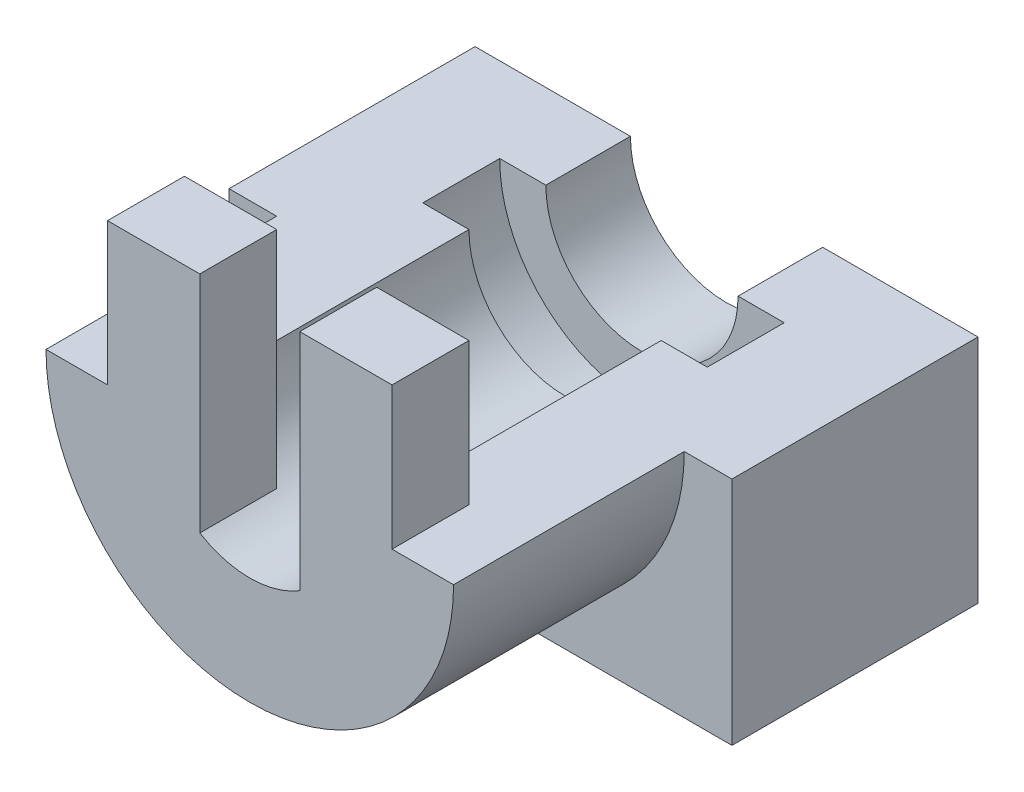
ISO-10303-21;
HEADER;
FILE_DESCRIPTION(('STEP AP214'),'2;1');
FILE_NAME('part.step','',(''),(''),'','','');
FILE_SCHEMA(('AUTOMOTIVE_DESIGN { 1 0 10303 214 1 1 1 1 }'));
ENDSEC;
DATA;
#1=APPLICATION_CONTEXT('core data for automotive mechanical design processes');
#2=APPLICATION_PROTOCOL_DEFINITION('international standard','automotive_design',2000,#1);
#3=PRODUCT_CONTEXT('',#1,'mechanical');
#4=PRODUCT('Part','Part','',(#3));
#5=PRODUCT_RELATED_PRODUCT_CATEGORY('part','',(#4));
#6=PRODUCT_DEFINITION_FORMATION('','',#4);
#7=PRODUCT_DEFINITION_CONTEXT('part definition',#1,'design');
#8=PRODUCT_DEFINITION('design','',#6,#7);
#9=PRODUCT_DEFINITION_SHAPE('','',#8);
#10=(LENGTH_UNIT() NAMED_UNIT(*) SI_UNIT(.MILLI.,.METRE.));
#11=(NAMED_UNIT(*) PLANE_ANGLE_UNIT() SI_UNIT($,.RADIAN.));
#12=(NAMED_UNIT(*) SI_UNIT($,.STERADIAN.) SOLID_ANGLE_UNIT());
#13=UNCERTAINTY_MEASURE_WITH_UNIT(LENGTH_MEASURE(1.E-05),#10,'distance_accuracy_value','');
#14=(GEOMETRIC_REPRESENTATION_CONTEXT(3) GLOBAL_UNCERTAINTY_ASSIGNED_CONTEXT((#13)) GLOBAL_UNIT_ASSIGNED_CONTEXT((#10,
#11,#12)) REPRESENTATION_CONTEXT('',''));
#15=CARTESIAN_POINT('',(0.,0.,0.));
#16=DIRECTION('',(0.,0.,1.));
#17=DIRECTION('',(1.,0.,0.));
#18=AXIS2_PLACEMENT_3D('',#15,#16,#17);
#19=CARTESIAN_POINT('',(0.,0.,0.));
#20=DIRECTION('',(0.,0.,1.));
#21=DIRECTION('',(1.,0.,0.));
#22=AXIS2_PLACEMENT_3D('',#19,#20,#21);
#23=PLANE('',#22);
#24=CARTESIAN_POINT('',(0.,0.,0.));
#25=DIRECTION('',(0.,0.,1.));
#26=DIRECTION('',(1.,0.,0.));
#27=AXIS2_PLACEMENT_3D('',#24,#25,#26);
#28=CIRCLE('',#27,6.25);
#29=CARTESIAN_POINT('',(-6.25,0.,0.));
#30=VERTEX_POINT('',#29);
#31=CARTESIAN_POINT('',(-3.25,-5.33853912601566,0.));
#32=VERTEX_POINT('',#31);
#33=EDGE_CURVE('E50',#30,#32,#28,.T.);
#34=ORIENTED_EDGE('',*,*,#33,.F.);
#35=DIRECTION('',(1.,0.,0.));
#36=VECTOR('',#35,1.);
#37=CARTESIAN_POINT('',(0.,0.,0.));
#38=LINE('',#37,#36);
#39=CARTESIAN_POINT('',(-9.25,0.,0.));
#40=VERTEX_POINT('',#39);
#41=EDGE_CURVE('E266',#40,#30,#38,.T.);
#42=ORIENTED_EDGE('',*,*,#41,.F.);
#43=DIRECTION('',(0.,-1.,0.));
#44=VECTOR('',#43,1.);
#45=CARTESIAN_POINT('',(-9.25,0.,0.));
#46=LINE('',#45,#44);
#47=CARTESIAN_POINT('',(-9.25,9.25,0.));
#48=VERTEX_POINT('',#47);
#49=EDGE_CURVE('E281',#48,#40,#46,.T.);
#50=ORIENTED_EDGE('',*,*,#49,.F.);
#51=DIRECTION('',(1.,0.,0.));
#52=VECTOR('',#51,1.);
#53=CARTESIAN_POINT('',(0.,9.25,0.));
#54=LINE('',#53,#52);
#55=CARTESIAN_POINT('',(-3.25,9.25000000000001,0.));
#56=VERTEX_POINT('',#55);
#57=EDGE_CURVE('E307',#48,#56,#54,.T.);
#58=ORIENTED_EDGE('',*,*,#57,.T.);
#59=DIRECTION('',(0.,-1.,0.));
#60=VECTOR('',#59,1.);
#61=CARTESIAN_POINT('',(-3.25,0.,0.));
#62=LINE('',#61,#60);
#63=EDGE_CURVE('E305',#56,#32,#62,.T.);
#64=ORIENTED_EDGE('',*,*,#63,.T.);
#65=EDGE_LOOP('',(#34,#42,#50,#58,#64));
#66=FACE_BOUND('',#65,.T.);
#67=ADVANCED_FACE('F40',(#66),#23,.F.);
#68=CARTESIAN_POINT('',(3.25000000000004,-5.33853912601563,0.));
#69=VERTEX_POINT('',#68);
#70=CARTESIAN_POINT('',(6.25,0.,0.));
#71=VERTEX_POINT('',#70);
#72=EDGE_CURVE('E11',#69,#71,#28,.T.);
#73=ORIENTED_EDGE('',*,*,#72,.F.);
#74=DIRECTION('',(0.,-1.,0.));
#75=VECTOR('',#74,1.);
#76=CARTESIAN_POINT('',(3.25,0.,0.));
#77=LINE('',#76,#75);
#78=CARTESIAN_POINT('',(3.25,9.25,0.));
#79=VERTEX_POINT('',#78);
#80=EDGE_CURVE('E302',#79,#69,#77,.T.);
#81=ORIENTED_EDGE('',*,*,#80,.F.);
#82=DIRECTION('',(1.,0.,0.));
#83=VECTOR('',#82,1.);
#84=CARTESIAN_POINT('',(0.,9.25,0.));
#85=LINE('',#84,#83);
#86=CARTESIAN_POINT('',(9.25,9.25,0.));
#87=VERTEX_POINT('',#86);
#88=EDGE_CURVE('E299',#79,#87,#85,.T.);
#89=ORIENTED_EDGE('',*,*,#88,.T.);
#90=DIRECTION('',(0.,-1.,0.));
#91=VECTOR('',#90,1.);
#92=CARTESIAN_POINT('',(9.25,0.,0.));
#93=LINE('',#92,#91);
#94=CARTESIAN_POINT('',(9.25,0.,0.));
#95=VERTEX_POINT('',#94);
#96=EDGE_CURVE('E275',#87,#95,#93,.T.);
#97=ORIENTED_EDGE('',*,*,#96,.T.);
#98=DIRECTION('',(1.,0.,0.));
#99=VECTOR('',#98,1.);
#100=CARTESIAN_POINT('',(0.,0.,0.));
#101=LINE('',#100,#99);
#102=EDGE_CURVE('E268',#71,#95,#101,.T.);
#103=ORIENTED_EDGE('',*,*,#102,.F.);
#104=EDGE_LOOP('',(#73,#81,#89,#97,#103));
#105=FACE_BOUND('',#104,.T.);
#106=ADVANCED_FACE('F336',(#105),#23,.F.);
#107=CARTESIAN_POINT('',(9.25,0.,5.));
#108=DIRECTION('',(1.,0.,0.));
#109=DIRECTION('',(0.,1.,0.));
#110=AXIS2_PLACEMENT_3D('',#107,#108,#109);
#111=PLANE('',#110);
#112=ORIENTED_EDGE('',*,*,#96,.F.);
#113=DIRECTION('',(0.,0.,-1.));
#114=VECTOR('',#113,1.);
#115=CARTESIAN_POINT('',(9.25,9.25,5.));
#116=LINE('',#115,#114);
#117=CARTESIAN_POINT('',(9.25,9.25,5.));
#118=VERTEX_POINT('',#117);
#119=EDGE_CURVE('E324',#118,#87,#116,.T.);
#120=ORIENTED_EDGE('',*,*,#119,.F.);
#121=DIRECTION('',(0.,-1.,0.));
#122=VECTOR('',#121,1.);
#123=CARTESIAN_POINT('',(9.25,0.,5.));
#124=LINE('',#123,#122);
#125=CARTESIAN_POINT('',(9.25,0.,5.));
#126=VERTEX_POINT('',#125);
#127=EDGE_CURVE('E278',#118,#126,#124,.T.);
#128=ORIENTED_EDGE('',*,*,#127,.T.);
#129=DIRECTION('',(0.,0.,-1.));
#130=VECTOR('',#129,1.);
#131=CARTESIAN_POINT('',(9.25,0.,5.));
#132=LINE('',#131,#130);
#133=EDGE_CURVE('E44',#126,#95,#132,.T.);
#134=ORIENTED_EDGE('',*,*,#133,.T.);
#135=EDGE_LOOP('',(#112,#120,#128,#134));
#136=FACE_BOUND('',#135,.T.);
#137=ADVANCED_FACE('F42',(#136),#111,.T.);
#138=CARTESIAN_POINT('',(0.,9.25,5.));
#139=DIRECTION('',(0.,1.,0.));
#140=DIRECTION('',(0.,0.,1.));
#141=AXIS2_PLACEMENT_3D('',#138,#139,#140);
#142=PLANE('',#141);
#143=ORIENTED_EDGE('',*,*,#88,.F.);
#144=DIRECTION('',(0.,0.,-1.));
#145=VECTOR('',#144,1.);
#146=CARTESIAN_POINT('',(3.25,9.25,5.));
#147=LINE('',#146,#145);
#148=CARTESIAN_POINT('',(3.25,9.25,5.));
#149=VERTEX_POINT('',#148);
#150=EDGE_CURVE('E323',#149,#79,#147,.T.);
#151=ORIENTED_EDGE('',*,*,#150,.F.);
#152=DIRECTION('',(1.,0.,0.));
#153=VECTOR('',#152,1.);
#154=CARTESIAN_POINT('',(0.,9.25,5.));
#155=LINE('',#154,#153);
#156=EDGE_CURVE('E280',#149,#118,#155,.T.);
#157=ORIENTED_EDGE('',*,*,#156,.T.);
#158=ORIENTED_EDGE('',*,*,#119,.T.);
#159=EDGE_LOOP('',(#143,#151,#157,#158));
#160=FACE_BOUND('',#159,.T.);
#161=ADVANCED_FACE('F346',(#160),#142,.T.);
#162=CARTESIAN_POINT('',(3.25,0.,5.));
#163=DIRECTION('',(1.,0.,0.));
#164=DIRECTION('',(0.,1.,0.));
#165=AXIS2_PLACEMENT_3D('',#162,#163,#164);
#166=PLANE('',#165);
#167=ORIENTED_EDGE('',*,*,#80,.T.);
#168=DIRECTION('',(0.,0.,-1.));
#169=VECTOR('',#168,1.);
#170=CARTESIAN_POINT('',(3.25000000000004,-5.33853912601563,5.));
#171=LINE('',#170,#169);
#172=CARTESIAN_POINT('',(3.25000000000004,-5.33853912601563,5.));
#173=VERTEX_POINT('',#172);
#174=EDGE_CURVE('E320',#173,#69,#171,.T.);
#175=ORIENTED_EDGE('',*,*,#174,.F.);
#176=DIRECTION('',(0.,-1.,0.));
#177=VECTOR('',#176,1.);
#178=CARTESIAN_POINT('',(3.25,0.,5.));
#179=LINE('',#178,#177);
#180=EDGE_CURVE('E284',#149,#173,#179,.T.);
#181=ORIENTED_EDGE('',*,*,#180,.F.);
#182=ORIENTED_EDGE('',*,*,#150,.T.);
#183=EDGE_LOOP('',(#167,#175,#181,#182));
#184=FACE_BOUND('',#183,.T.);
#185=ADVANCED_FACE('F345',(#184),#166,.F.);
#186=CARTESIAN_POINT('',(0.,0.,5.));
#187=DIRECTION('',(0.,0.,-1.));
#188=DIRECTION('',(-1.,0.,0.));
#189=AXIS2_PLACEMENT_3D('',#186,#187,#188);
#190=CYLINDRICAL_SURFACE('',#189,6.25);
#191=ORIENTED_EDGE('',*,*,#174,.T.);
#192=ORIENTED_EDGE('',*,*,#72,.T.);
#193=DIRECTION('',(0.,0.,1.));
#194=VECTOR('',#193,1.);
#195=CARTESIAN_POINT('',(6.25,0.,-10.));
#196=LINE('',#195,#194);
#197=CARTESIAN_POINT('',(6.25,0.,-15.5));
#198=VERTEX_POINT('',#197);
#199=EDGE_CURVE('E272',#198,#71,#196,.T.);
#200=ORIENTED_EDGE('',*,*,#199,.F.);
#201=CARTESIAN_POINT('',(0.,0.,-15.5));
#202=DIRECTION('',(0.,0.,1.));
#203=DIRECTION('',(-1.,0.,0.));
#204=AXIS2_PLACEMENT_3D('',#201,#202,#203);
#205=CIRCLE('',#204,6.25);
#206=CARTESIAN_POINT('',(-6.25,0.,-15.5));
#207=VERTEX_POINT('',#206);
#208=EDGE_CURVE('E215',#207,#198,#205,.T.);
#209=ORIENTED_EDGE('',*,*,#208,.F.);
#210=DIRECTION('',(0.,0.,1.));
#211=VECTOR('',#210,1.);
#212=CARTESIAN_POINT('',(-6.25,0.,-10.));
#213=LINE('',#212,#211);
#214=EDGE_CURVE('E271',#207,#30,#213,.T.);
#215=ORIENTED_EDGE('',*,*,#214,.T.);
#216=ORIENTED_EDGE('',*,*,#33,.T.);
#217=DIRECTION('',(0.,0.,-1.));
#218=VECTOR('',#217,1.);
#219=CARTESIAN_POINT('',(-3.25,-5.33853912601566,5.));
#220=LINE('',#219,#218);
#221=CARTESIAN_POINT('',(-3.25,-5.33853912601566,5.));
#222=VERTEX_POINT('',#221);
#223=EDGE_CURVE('E318',#222,#32,#220,.T.);
#224=ORIENTED_EDGE('',*,*,#223,.F.);
#225=CARTESIAN_POINT('',(0.,0.,5.));
#226=DIRECTION('',(0.,0.,1.));
#227=DIRECTION('',(1.,0.,0.));
#228=AXIS2_PLACEMENT_3D('',#225,#226,#227);
#229=CIRCLE('',#228,6.25);
#230=EDGE_CURVE('E286',#222,#173,#229,.T.);
#231=ORIENTED_EDGE('',*,*,#230,.T.);
#232=EDGE_LOOP('',(#191,#192,#200,#209,#215,#216,#224,#231));
#233=FACE_BOUND('',#232,.T.);
#234=ADVANCED_FACE('F339',(#233),#190,.F.);
#235=CARTESIAN_POINT('',(-3.25,0.,5.));
#236=DIRECTION('',(1.,0.,0.));
#237=DIRECTION('',(0.,1.,0.));
#238=AXIS2_PLACEMENT_3D('',#235,#236,#237);
#239=PLANE('',#238);
#240=ORIENTED_EDGE('',*,*,#63,.F.);
#241=DIRECTION('',(0.,0.,-1.));
#242=VECTOR('',#241,1.);
#243=CARTESIAN_POINT('',(-3.25,9.25000000000001,5.));
#244=LINE('',#243,#242);
#245=CARTESIAN_POINT('',(-3.25,9.25000000000001,5.));
#246=VERTEX_POINT('',#245);
#247=EDGE_CURVE('E316',#246,#56,#244,.T.);
#248=ORIENTED_EDGE('',*,*,#247,.F.);
#249=DIRECTION('',(0.,-1.,0.));
#250=VECTOR('',#249,1.);
#251=CARTESIAN_POINT('',(-3.25,0.,5.));
#252=LINE('',#251,#250);
#253=EDGE_CURVE('E289',#246,#222,#252,.T.);
#254=ORIENTED_EDGE('',*,*,#253,.T.);
#255=ORIENTED_EDGE('',*,*,#223,.T.);
#256=EDGE_LOOP('',(#240,#248,#254,#255));
#257=FACE_BOUND('',#256,.T.);
#258=ADVANCED_FACE('F392',(#257),#239,.T.);
#259=CARTESIAN_POINT('',(0.,9.25,5.));
#260=DIRECTION('',(0.,1.,0.));
#261=DIRECTION('',(0.,0.,1.));
#262=AXIS2_PLACEMENT_3D('',#259,#260,#261);
#263=PLANE('',#262);
#264=ORIENTED_EDGE('',*,*,#57,.F.);
#265=DIRECTION('',(0.,0.,-1.));
#266=VECTOR('',#265,1.);
#267=CARTESIAN_POINT('',(-9.25,9.25,5.));
#268=LINE('',#267,#266);
#269=CARTESIAN_POINT('',(-9.25,9.25,5.));
#270=VERTEX_POINT('',#269);
#271=EDGE_CURVE('E314',#270,#48,#268,.T.);
#272=ORIENTED_EDGE('',*,*,#271,.F.);
#273=DIRECTION('',(1.,0.,0.));
#274=VECTOR('',#273,1.);
#275=CARTESIAN_POINT('',(0.,9.25,5.));
#276=LINE('',#275,#274);
#277=EDGE_CURVE('E292',#270,#246,#276,.T.);
#278=ORIENTED_EDGE('',*,*,#277,.T.);
#279=ORIENTED_EDGE('',*,*,#247,.T.);
#280=EDGE_LOOP('',(#264,#272,#278,#279));
#281=FACE_BOUND('',#280,.T.);
#282=ADVANCED_FACE('F395',(#281),#263,.T.);
#283=CARTESIAN_POINT('',(-9.25,0.,5.));
#284=DIRECTION('',(1.,0.,0.));
#285=DIRECTION('',(0.,1.,0.));
#286=AXIS2_PLACEMENT_3D('',#283,#284,#285);
#287=PLANE('',#286);
#288=ORIENTED_EDGE('',*,*,#49,.T.);
#289=DIRECTION('',(0.,0.,-1.));
#290=VECTOR('',#289,1.);
#291=CARTESIAN_POINT('',(-9.25,0.,5.));
#292=LINE('',#291,#290);
#293=CARTESIAN_POINT('',(-9.25,0.,5.));
#294=VERTEX_POINT('',#293);
#295=EDGE_CURVE('E297',#294,#40,#292,.T.);
#296=ORIENTED_EDGE('',*,*,#295,.F.);
#297=DIRECTION('',(0.,-1.,0.));
#298=VECTOR('',#297,1.);
#299=CARTESIAN_POINT('',(-9.25,0.,5.));
#300=LINE('',#299,#298);
#301=EDGE_CURVE('E295',#270,#294,#300,.T.);
#302=ORIENTED_EDGE('',*,*,#301,.F.);
#303=ORIENTED_EDGE('',*,*,#271,.T.);
#304=EDGE_LOOP('',(#288,#296,#302,#303));
#305=FACE_BOUND('',#304,.T.);
#306=ADVANCED_FACE('F399',(#305),#287,.F.);
#307=CARTESIAN_POINT('',(0.,0.,5.));
#308=DIRECTION('',(0.,0.,1.));
#309=DIRECTION('',(1.,0.,0.));
#310=AXIS2_PLACEMENT_3D('',#307,#308,#309);
#311=PLANE('',#310);
#312=ORIENTED_EDGE('',*,*,#301,.T.);
#313=DIRECTION('',(-1.,0.,0.));
#314=VECTOR('',#313,1.);
#315=CARTESIAN_POINT('',(0.,0.,5.));
#316=LINE('',#315,#314);
#317=CARTESIAN_POINT('',(-13.25,0.,5.));
#318=VERTEX_POINT('',#317);
#319=EDGE_CURVE('E259',#294,#318,#316,.T.);
#320=ORIENTED_EDGE('',*,*,#319,.T.);
#321=CARTESIAN_POINT('',(0.,0.,5.));
#322=DIRECTION('',(0.,0.,1.));
#323=DIRECTION('',(1.,0.,0.));
#324=AXIS2_PLACEMENT_3D('',#321,#322,#323);
#325=CIRCLE('',#324,13.25);
#326=CARTESIAN_POINT('',(13.25,0.,5.));
#327=VERTEX_POINT('',#326);
#328=EDGE_CURVE('E256',#318,#327,#325,.T.);
#329=ORIENTED_EDGE('',*,*,#328,.T.);
#330=DIRECTION('',(-1.,0.,0.));
#331=VECTOR('',#330,1.);
#332=CARTESIAN_POINT('',(0.,0.,5.));
#333=LINE('',#332,#331);
#334=EDGE_CURVE('E253',#327,#126,#333,.T.);
#335=ORIENTED_EDGE('',*,*,#334,.T.);
#336=ORIENTED_EDGE('',*,*,#127,.F.);
#337=ORIENTED_EDGE('',*,*,#156,.F.);
#338=ORIENTED_EDGE('',*,*,#180,.T.);
#339=ORIENTED_EDGE('',*,*,#230,.F.);
#340=ORIENTED_EDGE('',*,*,#253,.F.);
#341=ORIENTED_EDGE('',*,*,#277,.F.);
#342=EDGE_LOOP('',(#312,#320,#329,#335,#336,#337,#338,#339,#340,#341));
#343=FACE_BOUND('',#342,.T.);
#344=ADVANCED_FACE('F349',(#343),#311,.T.);
#345=CARTESIAN_POINT('',(0.,0.,-10.));
#346=DIRECTION('',(0.,-1.,0.));
#347=DIRECTION('',(0.,0.,-1.));
#348=AXIS2_PLACEMENT_3D('',#345,#346,#347);
#349=PLANE('',#348);
#350=ORIENTED_EDGE('',*,*,#102,.T.);
#351=ORIENTED_EDGE('',*,*,#133,.F.);
#352=ORIENTED_EDGE('',*,*,#334,.F.);
#353=DIRECTION('',(0.,0.,-1.));
#354=VECTOR('',#353,1.);
#355=CARTESIAN_POINT('',(13.25,0.,34.6279007018722));
#356=LINE('',#355,#354);
#357=CARTESIAN_POINT('',(13.25,0.,-10.));
#358=VERTEX_POINT('',#357);
#359=EDGE_CURVE('E252',#327,#358,#356,.T.);
#360=ORIENTED_EDGE('',*,*,#359,.T.);
#361=DIRECTION('',(-1.,0.,0.));
#362=VECTOR('',#361,1.);
#363=CARTESIAN_POINT('',(0.,0.,-10.));
#364=LINE('',#363,#362);
#365=CARTESIAN_POINT('',(16.35,0.,-10.));
#366=VERTEX_POINT('',#365);
#367=EDGE_CURVE('E231',#366,#358,#364,.T.);
#368=ORIENTED_EDGE('',*,*,#367,.F.);
#369=DIRECTION('',(0.,0.,1.));
#370=VECTOR('',#369,1.);
#371=CARTESIAN_POINT('',(16.35,0.,-20.5));
#372=LINE('',#371,#370);
#373=CARTESIAN_POINT('',(16.35,0.,-26.));
#374=VERTEX_POINT('',#373);
#375=EDGE_CURVE('E240',#374,#366,#372,.T.);
#376=ORIENTED_EDGE('',*,*,#375,.F.);
#377=DIRECTION('',(1.,0.,0.));
#378=VECTOR('',#377,1.);
#379=CARTESIAN_POINT('',(16.35,0.,-26.));
#380=LINE('',#379,#378);
#381=CARTESIAN_POINT('',(6.25,0.,-26.));
#382=VERTEX_POINT('',#381);
#383=EDGE_CURVE('E190',#382,#374,#380,.T.);
#384=ORIENTED_EDGE('',*,*,#383,.F.);
#385=DIRECTION('',(0.,0.,1.));
#386=VECTOR('',#385,1.);
#387=CARTESIAN_POINT('',(6.25,0.,-26.));
#388=LINE('',#387,#386);
#389=CARTESIAN_POINT('',(6.25,0.,-20.5));
#390=VERTEX_POINT('',#389);
#391=EDGE_CURVE('E186',#382,#390,#388,.T.);
#392=ORIENTED_EDGE('',*,*,#391,.T.);
#393=DIRECTION('',(1.,0.,0.));
#394=VECTOR('',#393,1.);
#395=CARTESIAN_POINT('',(16.35,0.,-20.5));
#396=LINE('',#395,#394);
#397=CARTESIAN_POINT('',(9.25,0.,-20.5));
#398=VERTEX_POINT('',#397);
#399=EDGE_CURVE('E201',#390,#398,#396,.T.);
#400=ORIENTED_EDGE('',*,*,#399,.T.);
#401=DIRECTION('',(0.,0.,1.));
#402=VECTOR('',#401,1.);
#403=CARTESIAN_POINT('',(9.25,0.,-20.5));
#404=LINE('',#403,#402);
#405=CARTESIAN_POINT('',(9.25,0.,-15.5));
#406=VERTEX_POINT('',#405);
#407=EDGE_CURVE('E242',#398,#406,#404,.T.);
#408=ORIENTED_EDGE('',*,*,#407,.T.);
#409=DIRECTION('',(1.,0.,0.));
#410=VECTOR('',#409,1.);
#411=CARTESIAN_POINT('',(6.25,0.,-15.5));
#412=LINE('',#411,#410);
#413=EDGE_CURVE('E218',#198,#406,#412,.T.);
#414=ORIENTED_EDGE('',*,*,#413,.F.);
#415=ORIENTED_EDGE('',*,*,#199,.T.);
#416=EDGE_LOOP('',(#350,#351,#352,#360,#368,#376,#384,#392,#400,#408,#414,#415));
#417=FACE_BOUND('',#416,.T.);
#418=ADVANCED_FACE('F333',(#417),#349,.F.);
#419=CARTESIAN_POINT('',(0.,0.,-10.));
#420=DIRECTION('',(0.,-1.,0.));
#421=DIRECTION('',(0.,0.,-1.));
#422=AXIS2_PLACEMENT_3D('',#419,#420,#421);
#423=PLANE('',#422);
#424=ORIENTED_EDGE('',*,*,#214,.F.);
#425=DIRECTION('',(1.,0.,0.));
#426=VECTOR('',#425,1.);
#427=CARTESIAN_POINT('',(-9.25,0.,-15.5));
#428=LINE('',#427,#426);
#429=CARTESIAN_POINT('',(-9.25,0.,-15.5));
#430=VERTEX_POINT('',#429);
#431=EDGE_CURVE('E208',#430,#207,#428,.T.);
#432=ORIENTED_EDGE('',*,*,#431,.F.);
#433=DIRECTION('',(0.,0.,1.));
#434=VECTOR('',#433,1.);
#435=CARTESIAN_POINT('',(-9.25,0.,-20.5));
#436=LINE('',#435,#434);
#437=CARTESIAN_POINT('',(-9.25,0.,-20.5));
#438=VERTEX_POINT('',#437);
#439=EDGE_CURVE('E244',#438,#430,#436,.T.);
#440=ORIENTED_EDGE('',*,*,#439,.F.);
#441=DIRECTION('',(1.,0.,0.));
#442=VECTOR('',#441,1.);
#443=CARTESIAN_POINT('',(-6.25,0.,-20.5));
#444=LINE('',#443,#442);
#445=CARTESIAN_POINT('',(-6.25,0.,-20.5));
#446=VERTEX_POINT('',#445);
#447=EDGE_CURVE('E205',#438,#446,#444,.T.);
#448=ORIENTED_EDGE('',*,*,#447,.T.);
#449=DIRECTION('',(0.,0.,1.));
#450=VECTOR('',#449,1.);
#451=CARTESIAN_POINT('',(-6.25,0.,-26.));
#452=LINE('',#451,#450);
#453=CARTESIAN_POINT('',(-6.25,0.,-26.));
#454=VERTEX_POINT('',#453);
#455=EDGE_CURVE('E184',#454,#446,#452,.T.);
#456=ORIENTED_EDGE('',*,*,#455,.F.);
#457=DIRECTION('',(1.,0.,0.));
#458=VECTOR('',#457,1.);
#459=CARTESIAN_POINT('',(-6.25,0.,-26.));
#460=LINE('',#459,#458);
#461=CARTESIAN_POINT('',(-16.35,0.,-26.));
#462=VERTEX_POINT('',#461);
#463=EDGE_CURVE('E191',#462,#454,#460,.T.);
#464=ORIENTED_EDGE('',*,*,#463,.F.);
#465=DIRECTION('',(0.,0.,1.));
#466=VECTOR('',#465,1.);
#467=CARTESIAN_POINT('',(-16.35,0.,-20.5));
#468=LINE('',#467,#466);
#469=CARTESIAN_POINT('',(-16.35,0.,-10.));
#470=VERTEX_POINT('',#469);
#471=EDGE_CURVE('E246',#462,#470,#468,.T.);
#472=ORIENTED_EDGE('',*,*,#471,.T.);
#473=CARTESIAN_POINT('',(-13.25,0.,-10.));
#474=VERTEX_POINT('',#473);
#475=EDGE_CURVE('E229',#474,#470,#364,.T.);
#476=ORIENTED_EDGE('',*,*,#475,.F.);
#477=DIRECTION('',(0.,0.,-1.));
#478=VECTOR('',#477,1.);
#479=CARTESIAN_POINT('',(-13.25,0.,34.6279007018722));
#480=LINE('',#479,#478);
#481=EDGE_CURVE('E248',#318,#474,#480,.T.);
#482=ORIENTED_EDGE('',*,*,#481,.F.);
#483=ORIENTED_EDGE('',*,*,#319,.F.);
#484=ORIENTED_EDGE('',*,*,#295,.T.);
#485=ORIENTED_EDGE('',*,*,#41,.T.);
#486=EDGE_LOOP('',(#424,#432,#440,#448,#456,#464,#472,#476,#482,#483,#484,#485));
#487=FACE_BOUND('',#486,.T.);
#488=ADVANCED_FACE('F203',(#487),#423,.F.);
#489=CARTESIAN_POINT('',(0.,0.,34.6279007018722));
#490=DIRECTION('',(0.,0.,-1.));
#491=DIRECTION('',(-1.,0.,0.));
#492=AXIS2_PLACEMENT_3D('',#489,#490,#491);
#493=CYLINDRICAL_SURFACE('',#492,13.25);
#494=ORIENTED_EDGE('',*,*,#328,.F.);
#495=ORIENTED_EDGE('',*,*,#481,.T.);
#496=CARTESIAN_POINT('',(0.,0.,-10.));
#497=DIRECTION('',(0.,0.,1.));
#498=DIRECTION('',(1.,0.,0.));
#499=AXIS2_PLACEMENT_3D('',#496,#497,#498);
#500=CIRCLE('',#499,13.25);
#501=EDGE_CURVE('E249',#474,#358,#500,.T.);
#502=ORIENTED_EDGE('',*,*,#501,.T.);
#503=ORIENTED_EDGE('',*,*,#359,.F.);
#504=EDGE_LOOP('',(#494,#495,#502,#503));
#505=FACE_BOUND('',#504,.T.);
#506=ADVANCED_FACE('F353',(#505),#493,.T.);
#507=CARTESIAN_POINT('',(-16.35,0.,-20.5));
#508=DIRECTION('',(-1.,0.,0.));
#509=DIRECTION('',(0.,0.,1.));
#510=AXIS2_PLACEMENT_3D('',#507,#508,#509);
#511=PLANE('',#510);
#512=DIRECTION('',(0.,-1.,0.));
#513=VECTOR('',#512,1.);
#514=CARTESIAN_POINT('',(-16.35,0.,-10.));
#515=LINE('',#514,#513);
#516=CARTESIAN_POINT('',(-16.35,-15.,-10.));
#517=VERTEX_POINT('',#516);
#518=EDGE_CURVE('E221',#470,#517,#515,.T.);
#519=ORIENTED_EDGE('',*,*,#518,.F.);
#520=ORIENTED_EDGE('',*,*,#471,.F.);
#521=DIRECTION('',(0.,1.,0.));
#522=VECTOR('',#521,1.);
#523=CARTESIAN_POINT('',(-16.35,0.,-26.));
#524=LINE('',#523,#522);
#525=CARTESIAN_POINT('',(-16.35,-15.,-26.));
#526=VERTEX_POINT('',#525);
#527=EDGE_CURVE('E198',#526,#462,#524,.T.);
#528=ORIENTED_EDGE('',*,*,#527,.F.);
#529=DIRECTION('',(0.,0.,1.));
#530=VECTOR('',#529,1.);
#531=CARTESIAN_POINT('',(-16.35,-15.,-20.5));
#532=LINE('',#531,#530);
#533=EDGE_CURVE('E225',#526,#517,#532,.T.);
#534=ORIENTED_EDGE('',*,*,#533,.T.);
#535=EDGE_LOOP('',(#519,#520,#528,#534));
#536=FACE_BOUND('',#535,.T.);
#537=ADVANCED_FACE('F362',(#536),#511,.T.);
#538=CARTESIAN_POINT('',(0.,0.,-20.5));
#539=DIRECTION('',(0.,0.,1.));
#540=DIRECTION('',(1.,0.,0.));
#541=AXIS2_PLACEMENT_3D('',#538,#539,#540);
#542=CYLINDRICAL_SURFACE('',#541,9.25);
#543=CARTESIAN_POINT('',(0.,0.,-15.5));
#544=DIRECTION('',(0.,0.,-1.));
#545=DIRECTION('',(-1.,0.,0.));
#546=AXIS2_PLACEMENT_3D('',#543,#544,#545);
#547=CIRCLE('',#546,9.25);
#548=EDGE_CURVE('E57',#406,#430,#547,.T.);
#549=ORIENTED_EDGE('',*,*,#548,.F.);
#550=ORIENTED_EDGE('',*,*,#407,.F.);
#551=CARTESIAN_POINT('',(0.,0.,-20.5));
#552=DIRECTION('',(0.,0.,-1.));
#553=DIRECTION('',(-1.,0.,0.));
#554=AXIS2_PLACEMENT_3D('',#551,#552,#553);
#555=CIRCLE('',#554,9.25);
#556=EDGE_CURVE('E222',#398,#438,#555,.T.);
#557=ORIENTED_EDGE('',*,*,#556,.T.);
#558=ORIENTED_EDGE('',*,*,#439,.T.);
#559=EDGE_LOOP('',(#549,#550,#557,#558));
#560=FACE_BOUND('',#559,.T.);
#561=ADVANCED_FACE('F383',(#560),#542,.F.);
#562=CARTESIAN_POINT('',(16.35,0.,-20.5));
#563=DIRECTION('',(-1.,0.,0.));
#564=DIRECTION('',(0.,-1.,0.));
#565=AXIS2_PLACEMENT_3D('',#562,#563,#564);
#566=PLANE('',#565);
#567=DIRECTION('',(0.,-1.,0.));
#568=VECTOR('',#567,1.);
#569=CARTESIAN_POINT('',(16.35,0.,-10.));
#570=LINE('',#569,#568);
#571=CARTESIAN_POINT('',(16.35,-15.,-10.));
#572=VERTEX_POINT('',#571);
#573=EDGE_CURVE('E232',#366,#572,#570,.T.);
#574=ORIENTED_EDGE('',*,*,#573,.T.);
#575=DIRECTION('',(0.,0.,1.));
#576=VECTOR('',#575,1.);
#577=CARTESIAN_POINT('',(16.35,-15.,-20.5));
#578=LINE('',#577,#576);
#579=CARTESIAN_POINT('',(16.35,-15.,-26.));
#580=VERTEX_POINT('',#579);
#581=EDGE_CURVE('E237',#580,#572,#578,.T.);
#582=ORIENTED_EDGE('',*,*,#581,.F.);
#583=DIRECTION('',(0.,-1.,0.));
#584=VECTOR('',#583,1.);
#585=CARTESIAN_POINT('',(16.35,0.,-26.));
#586=LINE('',#585,#584);
#587=EDGE_CURVE('E372',#374,#580,#586,.T.);
#588=ORIENTED_EDGE('',*,*,#587,.F.);
#589=ORIENTED_EDGE('',*,*,#375,.T.);
#590=EDGE_LOOP('',(#574,#582,#588,#589));
#591=FACE_BOUND('',#590,.T.);
#592=ADVANCED_FACE('F371',(#591),#566,.F.);
#593=CARTESIAN_POINT('',(0.,-15.,-20.5));
#594=DIRECTION('',(0.,1.,0.));
#595=DIRECTION('',(0.,0.,1.));
#596=AXIS2_PLACEMENT_3D('',#593,#594,#595);
#597=PLANE('',#596);
#598=DIRECTION('',(-1.,0.,0.));
#599=VECTOR('',#598,1.);
#600=CARTESIAN_POINT('',(0.,-15.,-10.));
#601=LINE('',#600,#599);
#602=EDGE_CURVE('E226',#572,#517,#601,.T.);
#603=ORIENTED_EDGE('',*,*,#602,.T.);
#604=ORIENTED_EDGE('',*,*,#533,.F.);
#605=DIRECTION('',(-1.,0.,0.));
#606=VECTOR('',#605,1.);
#607=CARTESIAN_POINT('',(16.35,-15.,-26.));
#608=LINE('',#607,#606);
#609=EDGE_CURVE('E367',#580,#526,#608,.T.);
#610=ORIENTED_EDGE('',*,*,#609,.F.);
#611=ORIENTED_EDGE('',*,*,#581,.T.);
#612=EDGE_LOOP('',(#603,#604,#610,#611));
#613=FACE_BOUND('',#612,.T.);
#614=ADVANCED_FACE('F365',(#613),#597,.F.);
#615=CARTESIAN_POINT('',(0.,0.,-10.));
#616=DIRECTION('',(0.,0.,-1.));
#617=DIRECTION('',(-1.,0.,0.));
#618=AXIS2_PLACEMENT_3D('',#615,#616,#617);
#619=PLANE('',#618);
#620=ORIENTED_EDGE('',*,*,#501,.F.);
#621=ORIENTED_EDGE('',*,*,#475,.T.);
#622=ORIENTED_EDGE('',*,*,#518,.T.);
#623=ORIENTED_EDGE('',*,*,#602,.F.);
#624=ORIENTED_EDGE('',*,*,#573,.F.);
#625=ORIENTED_EDGE('',*,*,#367,.T.);
#626=EDGE_LOOP('',(#620,#621,#622,#623,#624,#625));
#627=FACE_BOUND('',#626,.T.);
#628=ADVANCED_FACE('F357',(#627),#619,.F.);
#629=CARTESIAN_POINT('',(0.,0.,-15.5));
#630=DIRECTION('',(0.,0.,-1.));
#631=DIRECTION('',(-1.,0.,0.));
#632=AXIS2_PLACEMENT_3D('',#629,#630,#631);
#633=PLANE('',#632);
#634=ORIENTED_EDGE('',*,*,#548,.T.);
#635=ORIENTED_EDGE('',*,*,#431,.T.);
#636=ORIENTED_EDGE('',*,*,#208,.T.);
#637=ORIENTED_EDGE('',*,*,#413,.T.);
#638=EDGE_LOOP('',(#634,#635,#636,#637));
#639=FACE_BOUND('',#638,.T.);
#640=ADVANCED_FACE('F387',(#639),#633,.T.);
#641=CARTESIAN_POINT('',(0.,0.,-20.5));
#642=DIRECTION('',(0.,0.,-1.));
#643=DIRECTION('',(-1.,0.,0.));
#644=AXIS2_PLACEMENT_3D('',#641,#642,#643);
#645=PLANE('',#644);
#646=ORIENTED_EDGE('',*,*,#556,.F.);
#647=ORIENTED_EDGE('',*,*,#399,.F.);
#648=CARTESIAN_POINT('',(0.,0.,-20.5));
#649=DIRECTION('',(0.,0.,1.));
#650=DIRECTION('',(-1.,0.,0.));
#651=AXIS2_PLACEMENT_3D('',#648,#649,#650);
#652=CIRCLE('',#651,6.25);
#653=EDGE_CURVE('E379',#446,#390,#652,.T.);
#654=ORIENTED_EDGE('',*,*,#653,.F.);
#655=ORIENTED_EDGE('',*,*,#447,.F.);
#656=EDGE_LOOP('',(#646,#647,#654,#655));
#657=FACE_BOUND('',#656,.T.);
#658=ADVANCED_FACE('F385',(#657),#645,.F.);
#659=CARTESIAN_POINT('',(0.,0.,-26.));
#660=DIRECTION('',(0.,0.,1.));
#661=DIRECTION('',(1.,0.,0.));
#662=AXIS2_PLACEMENT_3D('',#659,#660,#661);
#663=CYLINDRICAL_SURFACE('',#662,6.25);
#664=ORIENTED_EDGE('',*,*,#653,.T.);
#665=ORIENTED_EDGE('',*,*,#391,.F.);
#666=CARTESIAN_POINT('',(0.,0.,-26.));
#667=DIRECTION('',(0.,0.,1.));
#668=DIRECTION('',(-1.,0.,0.));
#669=AXIS2_PLACEMENT_3D('',#666,#667,#668);
#670=CIRCLE('',#669,6.25);
#671=EDGE_CURVE('E180',#454,#382,#670,.T.);
#672=ORIENTED_EDGE('',*,*,#671,.F.);
#673=ORIENTED_EDGE('',*,*,#455,.T.);
#674=EDGE_LOOP('',(#664,#665,#672,#673));
#675=FACE_BOUND('',#674,.T.);
#676=ADVANCED_FACE('F182',(#675),#663,.F.);
#677=CARTESIAN_POINT('',(0.,0.,-26.));
#678=DIRECTION('',(0.,0.,-1.));
#679=DIRECTION('',(-1.,0.,0.));
#680=AXIS2_PLACEMENT_3D('',#677,#678,#679);
#681=PLANE('',#680);
#682=ORIENTED_EDGE('',*,*,#463,.T.);
#683=ORIENTED_EDGE('',*,*,#671,.T.);
#684=ORIENTED_EDGE('',*,*,#383,.T.);
#685=ORIENTED_EDGE('',*,*,#587,.T.);
#686=ORIENTED_EDGE('',*,*,#609,.T.);
#687=ORIENTED_EDGE('',*,*,#527,.T.);
#688=EDGE_LOOP('',(#682,#683,#684,#685,#686,#687));
#689=FACE_BOUND('',#688,.T.);
#690=ADVANCED_FACE('F195',(#689),#681,.T.);
#691=CLOSED_SHELL('',(#67,#106,#137,#161,#185,#234,#258,#282,#306,#344,#418,#488,#506,#537,#561,
#592,#614,#628,#640,#658,#676,#690));
#692=MANIFOLD_SOLID_BREP('B2',#691);
#693=ADVANCED_BREP_SHAPE_REPRESENTATION('',(#18,#692),#14);
#694=SHAPE_DEFINITION_REPRESENTATION(#9,#693);
ENDSEC;
END-ISO-10303-21;
